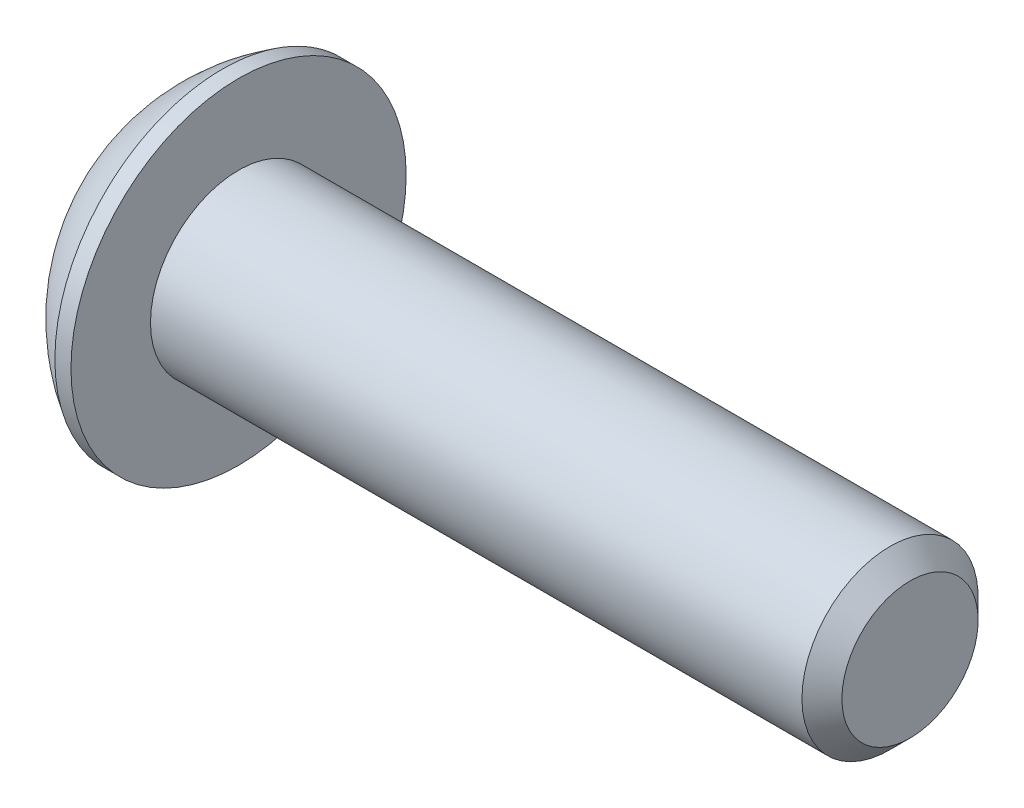
ISO-10303-21;
HEADER;
FILE_DESCRIPTION(('STEP AP214'),'2;1');
FILE_NAME('part.step','',(''),(''),'','','');
FILE_SCHEMA(('AUTOMOTIVE_DESIGN { 1 0 10303 214 1 1 1 1 }'));
ENDSEC;
DATA;
#1=APPLICATION_CONTEXT('core data for automotive mechanical design processes');
#2=APPLICATION_PROTOCOL_DEFINITION('international standard','automotive_design',2000,#1);
#3=PRODUCT_CONTEXT('',#1,'mechanical');
#4=PRODUCT('Part','Part','',(#3));
#5=PRODUCT_RELATED_PRODUCT_CATEGORY('part','',(#4));
#6=PRODUCT_DEFINITION_FORMATION('','',#4);
#7=PRODUCT_DEFINITION_CONTEXT('part definition',#1,'design');
#8=PRODUCT_DEFINITION('design','',#6,#7);
#9=PRODUCT_DEFINITION_SHAPE('','',#8);
#10=(LENGTH_UNIT() NAMED_UNIT(*) SI_UNIT(.MILLI.,.METRE.));
#11=(NAMED_UNIT(*) PLANE_ANGLE_UNIT() SI_UNIT($,.RADIAN.));
#12=(NAMED_UNIT(*) SI_UNIT($,.STERADIAN.) SOLID_ANGLE_UNIT());
#13=UNCERTAINTY_MEASURE_WITH_UNIT(LENGTH_MEASURE(1.E-05),#10,'distance_accuracy_value','');
#14=(GEOMETRIC_REPRESENTATION_CONTEXT(3) GLOBAL_UNCERTAINTY_ASSIGNED_CONTEXT((#13)) GLOBAL_UNIT_ASSIGNED_CONTEXT((#10,
#11,#12)) REPRESENTATION_CONTEXT('',''));
#15=CARTESIAN_POINT('',(0.,0.,0.));
#16=DIRECTION('',(0.,0.,1.));
#17=DIRECTION('',(1.,0.,0.));
#18=AXIS2_PLACEMENT_3D('',#15,#16,#17);
#19=CARTESIAN_POINT('',(1.32080000000034,0.,0.));
#20=DIRECTION('',(-1.,0.,0.));
#21=DIRECTION('',(0.,0.,1.));
#22=AXIS2_PLACEMENT_3D('',#19,#20,#21);
#23=CONICAL_SURFACE('',#22,1.1937999999998,1.04719755119608);
#24=CARTESIAN_POINT('',(2.01004075135902,0.,4.44089209850063E-13));
#25=VERTEX_POINT('',#24);
#26=VERTEX_LOOP('',#25);
#27=FACE_BOUND('',#26,.T.);
#28=CARTESIAN_POINT('',(1.32080000000009,0.,0.));
#29=DIRECTION('',(-1.,0.,0.));
#30=DIRECTION('',(0.,0.,1.));
#31=AXIS2_PLACEMENT_3D('',#28,#29,#30);
#32=CIRCLE('',#31,1.19380000000024);
#33=CARTESIAN_POINT('',(1.32080000000004,-1.03386112703797,0.59690000000006));
#34=VERTEX_POINT('',#33);
#35=CARTESIAN_POINT('',(1.32080000000004,0.,1.19380000000012));
#36=VERTEX_POINT('',#35);
#37=EDGE_CURVE('E19',#34,#36,#32,.T.);
#38=ORIENTED_EDGE('',*,*,#37,.T.);
#39=CARTESIAN_POINT('',(1.32080000000009,0.,0.));
#40=DIRECTION('',(-1.,0.,0.));
#41=DIRECTION('',(0.,0.,1.));
#42=AXIS2_PLACEMENT_3D('',#39,#40,#41);
#43=CIRCLE('',#42,1.19380000000024);
#44=CARTESIAN_POINT('',(1.32080000000004,1.03386112703797,0.596900000000061));
#45=VERTEX_POINT('',#44);
#46=EDGE_CURVE('E148',#36,#45,#43,.T.);
#47=ORIENTED_EDGE('',*,*,#46,.T.);
#48=CARTESIAN_POINT('',(1.32080000000009,0.,0.));
#49=DIRECTION('',(-1.,0.,0.));
#50=DIRECTION('',(0.,0.,1.));
#51=AXIS2_PLACEMENT_3D('',#48,#49,#50);
#52=CIRCLE('',#51,1.19380000000024);
#53=CARTESIAN_POINT('',(1.32080000000004,1.03386112703797,-0.596900000000061));
#54=VERTEX_POINT('',#53);
#55=EDGE_CURVE('E318',#45,#54,#52,.T.);
#56=ORIENTED_EDGE('',*,*,#55,.T.);
#57=CARTESIAN_POINT('',(1.32080000000009,0.,0.));
#58=DIRECTION('',(-1.,0.,0.));
#59=DIRECTION('',(0.,0.,1.));
#60=AXIS2_PLACEMENT_3D('',#57,#58,#59);
#61=CIRCLE('',#60,1.19380000000024);
#62=CARTESIAN_POINT('',(1.32080000000004,1.49457637585666E-12,-1.19380000000012));
#63=VERTEX_POINT('',#62);
#64=EDGE_CURVE('E319',#54,#63,#61,.T.);
#65=ORIENTED_EDGE('',*,*,#64,.T.);
#66=CARTESIAN_POINT('',(1.32080000000009,0.,0.));
#67=DIRECTION('',(-1.,0.,0.));
#68=DIRECTION('',(0.,0.,1.));
#69=AXIS2_PLACEMENT_3D('',#66,#67,#68);
#70=CIRCLE('',#69,1.19380000000024);
#71=CARTESIAN_POINT('',(1.32080000000004,-1.03386112703797,-0.59690000000006));
#72=VERTEX_POINT('',#71);
#73=EDGE_CURVE('E92',#63,#72,#70,.T.);
#74=ORIENTED_EDGE('',*,*,#73,.T.);
#75=CARTESIAN_POINT('',(1.32080000000009,0.,0.));
#76=DIRECTION('',(-1.,0.,0.));
#77=DIRECTION('',(0.,0.,1.));
#78=AXIS2_PLACEMENT_3D('',#75,#76,#77);
#79=CIRCLE('',#78,1.19380000000024);
#80=EDGE_CURVE('E88',#72,#34,#79,.T.);
#81=ORIENTED_EDGE('',*,*,#80,.T.);
#82=EDGE_LOOP('',(#38,#47,#56,#65,#74,#81));
#83=FACE_BOUND('',#82,.T.);
#84=ADVANCED_FACE('F16',(#27,#83),#23,.F.);
#85=CARTESIAN_POINT('',(1.3208,-2.06772225407572,-1.1938));
#86=DIRECTION('',(1.,0.,0.));
#87=DIRECTION('',(0.,0.,-1.));
#88=AXIS2_PLACEMENT_3D('',#85,#86,#87);
#89=PLANE('',#88);
#90=DIRECTION('',(0.,0.5,0.866025403784439));
#91=VECTOR('',#90,1.);
#92=CARTESIAN_POINT('',(1.3208,-1.37848150271715,0.));
#93=LINE('',#92,#91);
#94=CARTESIAN_POINT('',(1.3208,-0.689240751358574,1.1938));
#95=VERTEX_POINT('',#94);
#96=EDGE_CURVE('E100',#95,#34,#93,.F.);
#97=ORIENTED_EDGE('',*,*,#96,.F.);
#98=DIRECTION('',(0.,1.,0.));
#99=VECTOR('',#98,1.);
#100=CARTESIAN_POINT('',(1.3208,-0.689240751358574,1.1938));
#101=LINE('',#100,#99);
#102=EDGE_CURVE('E102',#36,#95,#101,.F.);
#103=ORIENTED_EDGE('',*,*,#102,.F.);
#104=ORIENTED_EDGE('',*,*,#37,.F.);
#105=EDGE_LOOP('',(#97,#103,#104));
#106=FACE_BOUND('',#105,.T.);
#107=ADVANCED_FACE('F98',(#106),#89,.F.);
#108=CARTESIAN_POINT('',(1.3208,-2.06772225407572,-1.1938));
#109=DIRECTION('',(1.,0.,0.));
#110=DIRECTION('',(0.,0.,-1.));
#111=AXIS2_PLACEMENT_3D('',#108,#109,#110);
#112=PLANE('',#111);
#113=DIRECTION('',(0.,-0.5,0.866025403784439));
#114=VECTOR('',#113,1.);
#115=CARTESIAN_POINT('',(1.3208,-0.689240751358574,-1.1938));
#116=LINE('',#115,#114);
#117=CARTESIAN_POINT('',(1.3208,-1.37848150271715,0.));
#118=VERTEX_POINT('',#117);
#119=EDGE_CURVE('E108',#118,#72,#116,.F.);
#120=ORIENTED_EDGE('',*,*,#119,.F.);
#121=DIRECTION('',(0.,0.5,0.866025403784439));
#122=VECTOR('',#121,1.);
#123=CARTESIAN_POINT('',(1.3208,-1.37848150271715,0.));
#124=LINE('',#123,#122);
#125=EDGE_CURVE('E105',#34,#118,#124,.F.);
#126=ORIENTED_EDGE('',*,*,#125,.F.);
#127=ORIENTED_EDGE('',*,*,#80,.F.);
#128=EDGE_LOOP('',(#120,#126,#127));
#129=FACE_BOUND('',#128,.T.);
#130=ADVANCED_FACE('F106',(#129),#112,.F.);
#131=CARTESIAN_POINT('',(1.3208,-2.06772225407572,-1.1938));
#132=DIRECTION('',(1.,0.,0.));
#133=DIRECTION('',(0.,0.,-1.));
#134=AXIS2_PLACEMENT_3D('',#131,#132,#133);
#135=PLANE('',#134);
#136=DIRECTION('',(0.,1.,0.));
#137=VECTOR('',#136,1.);
#138=CARTESIAN_POINT('',(1.3208,0.689240751358577,-1.1938));
#139=LINE('',#138,#137);
#140=CARTESIAN_POINT('',(1.3208,-0.689240751358574,-1.1938));
#141=VERTEX_POINT('',#140);
#142=EDGE_CURVE('E288',#141,#63,#139,.T.);
#143=ORIENTED_EDGE('',*,*,#142,.F.);
#144=DIRECTION('',(0.,-0.5,0.866025403784439));
#145=VECTOR('',#144,1.);
#146=CARTESIAN_POINT('',(1.3208,-0.689240751358574,-1.1938));
#147=LINE('',#146,#145);
#148=EDGE_CURVE('E300',#72,#141,#147,.F.);
#149=ORIENTED_EDGE('',*,*,#148,.F.);
#150=ORIENTED_EDGE('',*,*,#73,.F.);
#151=EDGE_LOOP('',(#143,#149,#150));
#152=FACE_BOUND('',#151,.T.);
#153=ADVANCED_FACE('F191',(#152),#135,.F.);
#154=CARTESIAN_POINT('',(1.3208,-2.06772225407572,-1.1938));
#155=DIRECTION('',(1.,0.,0.));
#156=DIRECTION('',(0.,0.,-1.));
#157=AXIS2_PLACEMENT_3D('',#154,#155,#156);
#158=PLANE('',#157);
#159=DIRECTION('',(0.,-0.5,-0.866025403784439));
#160=VECTOR('',#159,1.);
#161=CARTESIAN_POINT('',(1.3208,1.37848150271715,0.));
#162=LINE('',#161,#160);
#163=CARTESIAN_POINT('',(1.3208,0.689240751358577,-1.1938));
#164=VERTEX_POINT('',#163);
#165=EDGE_CURVE('E274',#164,#54,#162,.F.);
#166=ORIENTED_EDGE('',*,*,#165,.F.);
#167=DIRECTION('',(0.,1.,0.));
#168=VECTOR('',#167,1.);
#169=CARTESIAN_POINT('',(1.3208,0.689240751358577,-1.1938));
#170=LINE('',#169,#168);
#171=EDGE_CURVE('E285',#63,#164,#170,.T.);
#172=ORIENTED_EDGE('',*,*,#171,.F.);
#173=ORIENTED_EDGE('',*,*,#64,.F.);
#174=EDGE_LOOP('',(#166,#172,#173));
#175=FACE_BOUND('',#174,.T.);
#176=ADVANCED_FACE('F187',(#175),#158,.F.);
#177=CARTESIAN_POINT('',(1.3208,-2.06772225407572,-1.1938));
#178=DIRECTION('',(1.,0.,0.));
#179=DIRECTION('',(0.,0.,-1.));
#180=AXIS2_PLACEMENT_3D('',#177,#178,#179);
#181=PLANE('',#180);
#182=DIRECTION('',(0.,0.5,-0.866025403784439));
#183=VECTOR('',#182,1.);
#184=CARTESIAN_POINT('',(1.3208,0.689240751358576,1.1938));
#185=LINE('',#184,#183);
#186=CARTESIAN_POINT('',(1.3208,1.37848150271715,0.));
#187=VERTEX_POINT('',#186);
#188=EDGE_CURVE('E253',#187,#45,#185,.F.);
#189=ORIENTED_EDGE('',*,*,#188,.F.);
#190=DIRECTION('',(0.,-0.5,-0.866025403784439));
#191=VECTOR('',#190,1.);
#192=CARTESIAN_POINT('',(1.3208,1.37848150271715,0.));
#193=LINE('',#192,#191);
#194=EDGE_CURVE('E272',#54,#187,#193,.F.);
#195=ORIENTED_EDGE('',*,*,#194,.F.);
#196=ORIENTED_EDGE('',*,*,#55,.F.);
#197=EDGE_LOOP('',(#189,#195,#196));
#198=FACE_BOUND('',#197,.T.);
#199=ADVANCED_FACE('F183',(#198),#181,.F.);
#200=CARTESIAN_POINT('',(1.3208,-2.06772225407572,-1.1938));
#201=DIRECTION('',(1.,0.,0.));
#202=DIRECTION('',(0.,0.,-1.));
#203=AXIS2_PLACEMENT_3D('',#200,#201,#202);
#204=PLANE('',#203);
#205=DIRECTION('',(0.,1.,0.));
#206=VECTOR('',#205,1.);
#207=CARTESIAN_POINT('',(1.3208,-0.689240751358574,1.1938));
#208=LINE('',#207,#206);
#209=CARTESIAN_POINT('',(1.3208,0.689240751358576,1.1938));
#210=VERTEX_POINT('',#209);
#211=EDGE_CURVE('E117',#210,#36,#208,.F.);
#212=ORIENTED_EDGE('',*,*,#211,.F.);
#213=DIRECTION('',(0.,0.5,-0.866025403784439));
#214=VECTOR('',#213,1.);
#215=CARTESIAN_POINT('',(1.3208,0.689240751358576,1.1938));
#216=LINE('',#215,#214);
#217=EDGE_CURVE('E256',#45,#210,#216,.F.);
#218=ORIENTED_EDGE('',*,*,#217,.F.);
#219=ORIENTED_EDGE('',*,*,#46,.F.);
#220=EDGE_LOOP('',(#212,#218,#219));
#221=FACE_BOUND('',#220,.T.);
#222=ADVANCED_FACE('F179',(#221),#204,.F.);
#223=CARTESIAN_POINT('',(1.3208,-0.689240751358574,1.1938));
#224=DIRECTION('',(0.,0.,-1.));
#225=DIRECTION('',(0.,1.,0.));
#226=AXIS2_PLACEMENT_3D('',#223,#224,#225);
#227=PLANE('',#226);
#228=DIRECTION('',(0.,1.,0.));
#229=VECTOR('',#228,1.);
#230=CARTESIAN_POINT('',(0.,0.,1.1938));
#231=LINE('',#230,#229);
#232=CARTESIAN_POINT('',(0.,0.689240751358577,1.1938));
#233=VERTEX_POINT('',#232);
#234=CARTESIAN_POINT('',(0.,-0.689240751358574,1.1938));
#235=VERTEX_POINT('',#234);
#236=EDGE_CURVE('E250',#233,#235,#231,.F.);
#237=ORIENTED_EDGE('',*,*,#236,.F.);
#238=DIRECTION('',(1.,0.,0.));
#239=VECTOR('',#238,1.);
#240=CARTESIAN_POINT('',(1.3208,0.689240751358576,1.1938));
#241=LINE('',#240,#239);
#242=EDGE_CURVE('E262',#210,#233,#241,.F.);
#243=ORIENTED_EDGE('',*,*,#242,.F.);
#244=ORIENTED_EDGE('',*,*,#211,.T.);
#245=ORIENTED_EDGE('',*,*,#102,.T.);
#246=DIRECTION('',(1.,0.,0.));
#247=VECTOR('',#246,1.);
#248=CARTESIAN_POINT('',(1.3208,-0.689240751358574,1.1938));
#249=LINE('',#248,#247);
#250=EDGE_CURVE('E111',#235,#95,#249,.T.);
#251=ORIENTED_EDGE('',*,*,#250,.F.);
#252=EDGE_LOOP('',(#237,#243,#244,#245,#251));
#253=FACE_BOUND('',#252,.T.);
#254=ADVANCED_FACE('F176',(#253),#227,.T.);
#255=CARTESIAN_POINT('',(1.3208,-1.37848150271715,0.));
#256=DIRECTION('',(0.,0.866025403784439,-0.5));
#257=DIRECTION('',(0.,0.5,0.866025403784439));
#258=AXIS2_PLACEMENT_3D('',#255,#256,#257);
#259=PLANE('',#258);
#260=DIRECTION('',(0.,-0.5,-0.866025403784439));
#261=VECTOR('',#260,1.);
#262=CARTESIAN_POINT('',(0.,-0.689240751358574,1.1938));
#263=LINE('',#262,#261);
#264=CARTESIAN_POINT('',(0.,-1.37848150271715,0.));
#265=VERTEX_POINT('',#264);
#266=EDGE_CURVE('E247',#235,#265,#263,.T.);
#267=ORIENTED_EDGE('',*,*,#266,.F.);
#268=ORIENTED_EDGE('',*,*,#250,.T.);
#269=ORIENTED_EDGE('',*,*,#96,.T.);
#270=ORIENTED_EDGE('',*,*,#125,.T.);
#271=DIRECTION('',(1.,0.,0.));
#272=VECTOR('',#271,1.);
#273=CARTESIAN_POINT('',(1.3208,-1.37848150271715,0.));
#274=LINE('',#273,#272);
#275=EDGE_CURVE('E297',#265,#118,#274,.T.);
#276=ORIENTED_EDGE('',*,*,#275,.F.);
#277=EDGE_LOOP('',(#267,#268,#269,#270,#276));
#278=FACE_BOUND('',#277,.T.);
#279=ADVANCED_FACE('F115',(#278),#259,.T.);
#280=CARTESIAN_POINT('',(1.3208,-0.689240751358574,-1.1938));
#281=DIRECTION('',(0.,0.866025403784439,0.5));
#282=DIRECTION('',(0.,-0.5,0.866025403784439));
#283=AXIS2_PLACEMENT_3D('',#280,#281,#282);
#284=PLANE('',#283);
#285=DIRECTION('',(0.,0.5,-0.866025403784439));
#286=VECTOR('',#285,1.);
#287=CARTESIAN_POINT('',(0.,-1.37848150271715,0.));
#288=LINE('',#287,#286);
#289=CARTESIAN_POINT('',(0.,-0.689240751358574,-1.1938));
#290=VERTEX_POINT('',#289);
#291=EDGE_CURVE('E244',#265,#290,#288,.T.);
#292=ORIENTED_EDGE('',*,*,#291,.F.);
#293=ORIENTED_EDGE('',*,*,#275,.T.);
#294=ORIENTED_EDGE('',*,*,#119,.T.);
#295=ORIENTED_EDGE('',*,*,#148,.T.);
#296=DIRECTION('',(1.,0.,0.));
#297=VECTOR('',#296,1.);
#298=CARTESIAN_POINT('',(1.3208,-0.689240751358574,-1.1938));
#299=LINE('',#298,#297);
#300=EDGE_CURVE('E282',#290,#141,#299,.T.);
#301=ORIENTED_EDGE('',*,*,#300,.F.);
#302=EDGE_LOOP('',(#292,#293,#294,#295,#301));
#303=FACE_BOUND('',#302,.T.);
#304=ADVANCED_FACE('F169',(#303),#284,.T.);
#305=CARTESIAN_POINT('',(1.3208,0.689240751358577,-1.1938));
#306=DIRECTION('',(0.,0.,1.));
#307=DIRECTION('',(1.,0.,0.));
#308=AXIS2_PLACEMENT_3D('',#305,#306,#307);
#309=PLANE('',#308);
#310=DIRECTION('',(0.,1.,0.));
#311=VECTOR('',#310,1.);
#312=CARTESIAN_POINT('',(0.,0.,-1.1938));
#313=LINE('',#312,#311);
#314=CARTESIAN_POINT('',(0.,0.689240751358577,-1.1938));
#315=VERTEX_POINT('',#314);
#316=EDGE_CURVE('E241',#290,#315,#313,.T.);
#317=ORIENTED_EDGE('',*,*,#316,.F.);
#318=ORIENTED_EDGE('',*,*,#300,.T.);
#319=ORIENTED_EDGE('',*,*,#142,.T.);
#320=ORIENTED_EDGE('',*,*,#171,.T.);
#321=DIRECTION('',(1.,0.,0.));
#322=VECTOR('',#321,1.);
#323=CARTESIAN_POINT('',(1.3208,0.689240751358577,-1.1938));
#324=LINE('',#323,#322);
#325=EDGE_CURVE('E257',#315,#164,#324,.T.);
#326=ORIENTED_EDGE('',*,*,#325,.F.);
#327=EDGE_LOOP('',(#317,#318,#319,#320,#326));
#328=FACE_BOUND('',#327,.T.);
#329=ADVANCED_FACE('F166',(#328),#309,.T.);
#330=CARTESIAN_POINT('',(1.3208,1.37848150271715,0.));
#331=DIRECTION('',(0.,-0.866025403784439,0.5));
#332=DIRECTION('',(0.,-0.5,-0.866025403784439));
#333=AXIS2_PLACEMENT_3D('',#330,#331,#332);
#334=PLANE('',#333);
#335=DIRECTION('',(0.,0.5,0.866025403784439));
#336=VECTOR('',#335,1.);
#337=CARTESIAN_POINT('',(0.,0.689240751358577,-1.1938));
#338=LINE('',#337,#336);
#339=CARTESIAN_POINT('',(0.,1.37848150271715,0.));
#340=VERTEX_POINT('',#339);
#341=EDGE_CURVE('E238',#315,#340,#338,.T.);
#342=ORIENTED_EDGE('',*,*,#341,.F.);
#343=ORIENTED_EDGE('',*,*,#325,.T.);
#344=ORIENTED_EDGE('',*,*,#165,.T.);
#345=ORIENTED_EDGE('',*,*,#194,.T.);
#346=DIRECTION('',(1.,0.,0.));
#347=VECTOR('',#346,1.);
#348=CARTESIAN_POINT('',(1.3208,1.37848150271715,0.));
#349=LINE('',#348,#347);
#350=EDGE_CURVE('E34',#340,#187,#349,.T.);
#351=ORIENTED_EDGE('',*,*,#350,.F.);
#352=EDGE_LOOP('',(#342,#343,#344,#345,#351));
#353=FACE_BOUND('',#352,.T.);
#354=ADVANCED_FACE('F162',(#353),#334,.T.);
#355=CARTESIAN_POINT('',(1.3208,0.689240751358576,1.1938));
#356=DIRECTION('',(0.,-0.866025403784439,-0.5));
#357=DIRECTION('',(0.,0.5,-0.866025403784439));
#358=AXIS2_PLACEMENT_3D('',#355,#356,#357);
#359=PLANE('',#358);
#360=DIRECTION('',(0.,-0.5,0.866025403784439));
#361=VECTOR('',#360,1.);
#362=CARTESIAN_POINT('',(0.,1.37848150271715,0.));
#363=LINE('',#362,#361);
#364=EDGE_CURVE('E147',#340,#233,#363,.T.);
#365=ORIENTED_EDGE('',*,*,#364,.F.);
#366=ORIENTED_EDGE('',*,*,#350,.T.);
#367=ORIENTED_EDGE('',*,*,#188,.T.);
#368=ORIENTED_EDGE('',*,*,#217,.T.);
#369=ORIENTED_EDGE('',*,*,#242,.T.);
#370=EDGE_LOOP('',(#365,#366,#367,#368,#369));
#371=FACE_BOUND('',#370,.T.);
#372=ADVANCED_FACE('F158',(#371),#359,.T.);
#373=CARTESIAN_POINT('',(0.,0.,0.));
#374=DIRECTION('',(-1.,0.,0.));
#375=DIRECTION('',(0.,0.,1.));
#376=AXIS2_PLACEMENT_3D('',#373,#374,#375);
#377=PLANE('',#376);
#378=ORIENTED_EDGE('',*,*,#341,.T.);
#379=ORIENTED_EDGE('',*,*,#364,.T.);
#380=ORIENTED_EDGE('',*,*,#236,.T.);
#381=ORIENTED_EDGE('',*,*,#266,.T.);
#382=ORIENTED_EDGE('',*,*,#291,.T.);
#383=ORIENTED_EDGE('',*,*,#316,.T.);
#384=EDGE_LOOP('',(#378,#379,#380,#381,#382,#383));
#385=FACE_BOUND('',#384,.T.);
#386=CARTESIAN_POINT('',(0.,1.9812,0.));
#387=CARTESIAN_POINT('',(0.,1.9811996664299,0.0556258831179428));
#388=CARTESIAN_POINT('',(0.,1.97885520380442,0.111261989398606));
#389=CARTESIAN_POINT('',(0.,1.96949260169541,0.222149719830458));
#390=CARTESIAN_POINT('',(0.,1.96247308239605,0.277401225602895));
#391=CARTESIAN_POINT('',(0.,1.94379192841038,0.387209508139747));
#392=CARTESIAN_POINT('',(-1.85325793235264E-13,1.93212292489526,0.441765039546365));
#393=CARTESIAN_POINT('',(1.86344214223505E-13,1.90422331175315,0.549729449347493));
#394=CARTESIAN_POINT('',(6.94543371897454E-13,1.88798900035338,0.603137359208869));
#395=CARTESIAN_POINT('',(1.15501975216981E-12,1.83266214476501,0.760839131321828));
#396=CARTESIAN_POINT('',(0.,1.78690023648845,0.862876433575429));
#397=CARTESIAN_POINT('',(0.,1.67887358150667,1.05780719540872));
#398=CARTESIAN_POINT('',(9.54193214892627E-13,1.6166082074585,1.15070030720801));
#399=CARTESIAN_POINT('',(5.94805591894675E-13,1.51224157140982,1.28116890915697));
#400=CARTESIAN_POINT('',(1.63221293851378E-13,1.4755970394354,1.32320451127026));
#401=CARTESIAN_POINT('',(-1.62196980336157E-13,1.39893832619713,1.40400288695709));
#402=CARTESIAN_POINT('',(0.,1.35892742784698,1.44276877695455));
#403=CARTESIAN_POINT('',(1.14362537325405E-13,1.23416504602197,1.55382272417904));
#404=CARTESIAN_POINT('',(0.,1.14466125559859,1.62089527952111));
#405=CARTESIAN_POINT('',(0.,0.955712144178167,1.7390221808118));
#406=CARTESIAN_POINT('',(0.,0.856267198233564,1.79007713076007));
#407=CARTESIAN_POINT('',(0.,0.650206345910843,1.87477637530954));
#408=CARTESIAN_POINT('',(0.,0.543590516134855,1.90842085586267));
#409=CARTESIAN_POINT('',(0.,0.326226155292018,1.95733039300656));
#410=CARTESIAN_POINT('',(0.,0.21547760215793,1.97259535144288));
#411=CARTESIAN_POINT('',(0.,-0.00701040587544639,1.98431697865418));
#412=CARTESIAN_POINT('',(0.,-0.118749860774734,1.98077364742917));
#413=CARTESIAN_POINT('',(0.,-0.340050178355485,1.95497485623825));
#414=CARTESIAN_POINT('',(0.,-0.449611052668255,1.93271949620218));
#415=CARTESIAN_POINT('',(0.,-0.663431110729174,1.87014138774523));
#416=CARTESIAN_POINT('',(0.,-0.76769023783852,1.82981844635272));
#417=CARTESIAN_POINT('',(0.,-0.968005760719347,1.73219968377096));
#418=CARTESIAN_POINT('',(0.,-1.0640618469811,1.6749032225164));
#419=CARTESIAN_POINT('',(0.,-1.19980276751283,1.57757371205873));
#420=CARTESIAN_POINT('',(0.,-1.24366557129213,1.54322665019466));
#421=CARTESIAN_POINT('',(0.,-1.32838995706696,1.47093063174264));
#422=CARTESIAN_POINT('',(0.,-1.36924860178706,1.43297823102439));
#423=CARTESIAN_POINT('',(0.,-1.48674671849223,1.31419842051173));
#424=CARTESIAN_POINT('',(0.,-1.55842832343237,1.22836221289311));
#425=CARTESIAN_POINT('',(0.,-1.6863396856475,1.04586168272493));
#426=CARTESIAN_POINT('',(0.,-1.7425700302488,0.949197771949774));
#427=CARTESIAN_POINT('',(0.,-1.8141614250401,0.798182600298684));
#428=CARTESIAN_POINT('',(0.,-1.83591780585875,0.746776203847791));
#429=CARTESIAN_POINT('',(0.,-1.87500754181092,0.642341081688636));
#430=CARTESIAN_POINT('',(0.,-1.89234447645404,0.589313708122847));
#431=CARTESIAN_POINT('',(0.,-1.92246053433554,0.482076273028395));
#432=CARTESIAN_POINT('',(0.,-1.93524685475118,0.42786822425751));
#433=CARTESIAN_POINT('',(0.,-1.95620937250494,0.318578151844611));
#434=CARTESIAN_POINT('',(0.,-1.96438692958147,0.263496390912872));
#435=CARTESIAN_POINT('',(0.,-1.97388528284653,0.173607715038558));
#436=CARTESIAN_POINT('',(0.,-1.97662743364426,0.138944718024998));
#437=CARTESIAN_POINT('',(0.,-1.98028489645283,0.0695224782567002));
#438=CARTESIAN_POINT('',(0.,-1.98120020846367,0.0347632355019631));
#439=CARTESIAN_POINT('',(0.,-1.9811996664299,-0.0556258831179437));
#440=CARTESIAN_POINT('',(0.,-1.97885520380442,-0.111261989398607));
#441=CARTESIAN_POINT('',(0.,-1.96949260169541,-0.222149719830459));
#442=CARTESIAN_POINT('',(0.,-1.96247308239605,-0.277401225602897));
#443=CARTESIAN_POINT('',(0.,-1.94379192841039,-0.387209508139749));
#444=CARTESIAN_POINT('',(-1.85269749640691E-13,-1.93212292489526,-0.441765039546367));
#445=CARTESIAN_POINT('',(1.86288125054388E-13,-1.90422331175315,-0.549729449347495));
#446=CARTESIAN_POINT('',(6.94525090263764E-13,-1.88798900035338,-0.603137359208872));
#447=CARTESIAN_POINT('',(1.15505622829081E-12,-1.83266214476501,-0.760839131321831));
#448=CARTESIAN_POINT('',(0.,-1.78690023648845,-0.862876433575431));
#449=CARTESIAN_POINT('',(0.,-1.67887358150667,-1.05780719540872));
#450=CARTESIAN_POINT('',(9.54248812869379E-13,-1.6166082074585,-1.15070030720801));
#451=CARTESIAN_POINT('',(5.94777756479239E-13,-1.51224157140982,-1.28116890915698));
#452=CARTESIAN_POINT('',(1.63138949183833E-13,-1.47559703943539,-1.32320451127027));
#453=CARTESIAN_POINT('',(-1.62114715061273E-13,-1.39893832619713,-1.40400288695709));
#454=CARTESIAN_POINT('',(0.,-1.35892742784699,-1.44276877695455));
#455=CARTESIAN_POINT('',(1.13760489124207E-13,-1.23416504602197,-1.55382272417904));
#456=CARTESIAN_POINT('',(0.,-1.14466125559859,-1.62089527952111));
#457=CARTESIAN_POINT('',(0.,-0.95571214417816,-1.73902218081179));
#458=CARTESIAN_POINT('',(0.,-0.856267198233559,-1.79007713076007));
#459=CARTESIAN_POINT('',(0.,-0.650206345910841,-1.87477637530954));
#460=CARTESIAN_POINT('',(0.,-0.543590516134854,-1.90842085586267));
#461=CARTESIAN_POINT('',(0.,-0.326226155292018,-1.95733039300657));
#462=CARTESIAN_POINT('',(0.,-0.215477602157929,-1.97259535144288));
#463=CARTESIAN_POINT('',(0.,0.0070104058754487,-1.98431697865418));
#464=CARTESIAN_POINT('',(0.,0.118749860774737,-1.98077364742916));
#465=CARTESIAN_POINT('',(0.,0.340050178355489,-1.95497485623824));
#466=CARTESIAN_POINT('',(0.,0.44961105266826,-1.93271949620218));
#467=CARTESIAN_POINT('',(0.,0.663431110729178,-1.87014138774524));
#468=CARTESIAN_POINT('',(0.,0.767690237838524,-1.82981844635272));
#469=CARTESIAN_POINT('',(0.,0.968005760719348,-1.73219968377096));
#470=CARTESIAN_POINT('',(0.,1.0640618469811,-1.67490322251639));
#471=CARTESIAN_POINT('',(0.,1.19980276751283,-1.57757371205873));
#472=CARTESIAN_POINT('',(0.,1.24366557129214,-1.54322665019465));
#473=CARTESIAN_POINT('',(0.,1.32838995706696,-1.47093063174263));
#474=CARTESIAN_POINT('',(0.,1.36924860178706,-1.43297823102439));
#475=CARTESIAN_POINT('',(0.,1.48674671849223,-1.31419842051172));
#476=CARTESIAN_POINT('',(0.,1.55842832343237,-1.22836221289311));
#477=CARTESIAN_POINT('',(0.,1.6863396856475,-1.04586168272492));
#478=CARTESIAN_POINT('',(0.,1.7425700302488,-0.949197771949768));
#479=CARTESIAN_POINT('',(0.,1.8141614250401,-0.798182600298677));
#480=CARTESIAN_POINT('',(0.,1.83591780585875,-0.746776203847785));
#481=CARTESIAN_POINT('',(0.,1.87500754181092,-0.64234108168863));
#482=CARTESIAN_POINT('',(0.,1.89234447645404,-0.589313708122841));
#483=CARTESIAN_POINT('',(0.,1.92246053433555,-0.482076273028389));
#484=CARTESIAN_POINT('',(0.,1.93524685475118,-0.427868224257505));
#485=CARTESIAN_POINT('',(0.,1.95620937250494,-0.318578151844605));
#486=CARTESIAN_POINT('',(0.,1.96438692958147,-0.263496390912866));
#487=CARTESIAN_POINT('',(0.,1.97388528284653,-0.173607715038553));
#488=CARTESIAN_POINT('',(0.,1.97662743364426,-0.138944718024994));
#489=CARTESIAN_POINT('',(0.,1.98028489645283,-0.0695224782566989));
#490=CARTESIAN_POINT('',(0.,1.98120020846367,-0.034763235501963));
#491=CARTESIAN_POINT('',(0.,1.9812,0.));
#492=B_SPLINE_CURVE_WITH_KNOTS('',3,(#386,#387,#388,#389,#390,#391,#392,#393,#394,#395,#396,
#397,#398,#399,#400,#401,#402,#403,#404,#405,#406,#407,#408,#409,#410,#411,#412,#413,#414,#415,
#416,#417,#418,#419,#420,#421,#422,#423,#424,#425,#426,#427,#428,#429,#430,#431,#432,#433,#434,
#435,#436,#437,#438,#439,#440,#441,#442,#443,#444,#445,#446,#447,#448,#449,#450,#451,#452,#453,
#454,#455,#456,#457,#458,#459,#460,#461,#462,#463,#464,#465,#466,#467,#468,#469,#470,#471,#472,
#473,#474,#475,#476,#477,#478,#479,#480,#481,#482,#483,#484,#485,#486,#487,#488,#489,#490,#491),
.UNSPECIFIED.,.T.,.F.,(4,2,2,2,2,2,2,2,2,2,2,2,2,2,2,2,2,2,2,2,2,2,2,2,2,2,2,2,2,2,2,2,2,2,2,2,
2,2,2,2,2,2,2,2,2,2,2,2,2,2,2,2,4),(0.,0.166845646007828,0.333740557374255,0.500901034367693,
0.668197445942386,1.00199278686282,1.33580081809885,1.50292354032982,1.6698851310853,
2.00370118900129,2.33750465770544,2.67130456115909,3.005106247238,3.33890793331696,
3.67270783677065,4.00651130547476,4.34032736339026,4.50728895414554,4.67441167637632,
5.00821970761259,5.34201504853332,5.50931146010827,5.67647193710191,5.84336684846844,
6.0102124944764,6.11448220058334,6.21875190669029,6.38559755269812,6.55249246406454,
6.71965294105798,6.88694935263268,7.22074469355311,7.55455272478915,7.72167544702011,
7.88863703777559,8.22245309569158,8.55625656439573,8.89005646784938,9.2238581539283,
9.55765984000725,9.89145974346094,10.2252632121651,10.5590792700806,10.7260408608358,
10.8931635830666,11.2269716143029,11.5607669552236,11.7280633667986,11.8952238437922,
12.0621187551587,12.2289644011667,12.3332341072736,12.4375038133806),.UNSPECIFIED.);
#493=CARTESIAN_POINT('',(0.,1.9812,0.));
#494=VERTEX_POINT('',#493);
#495=EDGE_CURVE('E139',#494,#494,#492,.T.);
#496=ORIENTED_EDGE('',*,*,#495,.F.);
#497=EDGE_LOOP('',(#496));
#498=FACE_BOUND('',#497,.T.);
#499=ADVANCED_FACE('F154',(#385,#498),#377,.T.);
#500=CARTESIAN_POINT('',(4.13385,0.,0.));
#501=DIRECTION('',(0.,1.,0.));
#502=DIRECTION('',(1.,0.,0.));
#503=AXIS2_PLACEMENT_3D('',#500,#501,#502);
#504=SPHERICAL_SURFACE('',#503,4.58408870578439);
#505=CARTESIAN_POINT('',(1.8288,0.,0.));
#506=DIRECTION('',(-1.,0.,0.));
#507=DIRECTION('',(0.,0.,1.));
#508=AXIS2_PLACEMENT_3D('',#505,#506,#507);
#509=CIRCLE('',#508,3.9624);
#510=CARTESIAN_POINT('',(1.8288,0.,3.9624));
#511=VERTEX_POINT('',#510);
#512=EDGE_CURVE('E136',#511,#511,#509,.F.);
#513=ORIENTED_EDGE('',*,*,#512,.F.);
#514=EDGE_LOOP('',(#513));
#515=FACE_BOUND('',#514,.T.);
#516=ORIENTED_EDGE('',*,*,#495,.T.);
#517=EDGE_LOOP('',(#516));
#518=FACE_BOUND('',#517,.T.);
#519=ADVANCED_FACE('F150',(#515,#518),#504,.T.);
#520=CARTESIAN_POINT('',(18.0848,0.,0.));
#521=DIRECTION('',(-1.,0.,0.));
#522=DIRECTION('',(0.,0.,1.));
#523=AXIS2_PLACEMENT_3D('',#520,#521,#522);
#524=PLANE('',#523);
#525=CARTESIAN_POINT('',(18.0847999999969,0.,0.));
#526=DIRECTION('',(-1.,0.,0.));
#527=DIRECTION('',(0.,0.,1.));
#528=AXIS2_PLACEMENT_3D('',#525,#526,#527);
#529=CIRCLE('',#528,1.61036000002923);
#530=CARTESIAN_POINT('',(18.0847999999969,0.,1.61036000002923));
#531=VERTEX_POINT('',#530);
#532=EDGE_CURVE('E133',#531,#531,#529,.T.);
#533=ORIENTED_EDGE('',*,*,#532,.F.);
#534=EDGE_LOOP('',(#533));
#535=FACE_BOUND('',#534,.T.);
#536=ADVANCED_FACE('F222',(#535),#524,.F.);
#537=CARTESIAN_POINT('',(0.,0.,0.));
#538=DIRECTION('',(-1.,0.,0.));
#539=DIRECTION('',(0.,0.,1.));
#540=AXIS2_PLACEMENT_3D('',#537,#538,#539);
#541=CYLINDRICAL_SURFACE('',#540,3.9624);
#542=ORIENTED_EDGE('',*,*,#512,.T.);
#543=EDGE_LOOP('',(#542));
#544=FACE_BOUND('',#543,.T.);
#545=CARTESIAN_POINT('',(2.2098,0.,0.));
#546=DIRECTION('',(-1.,0.,0.));
#547=DIRECTION('',(0.,0.,1.));
#548=AXIS2_PLACEMENT_3D('',#545,#546,#547);
#549=CIRCLE('',#548,3.9624);
#550=CARTESIAN_POINT('',(2.2098,0.,3.9624));
#551=VERTEX_POINT('',#550);
#552=EDGE_CURVE('E130',#551,#551,#549,.T.);
#553=ORIENTED_EDGE('',*,*,#552,.T.);
#554=EDGE_LOOP('',(#553));
#555=FACE_BOUND('',#554,.T.);
#556=ADVANCED_FACE('F219',(#544,#555),#541,.T.);
#557=CARTESIAN_POINT('',(17.61235999993,0.,0.));
#558=DIRECTION('',(-1.,0.,0.));
#559=DIRECTION('',(0.,0.,1.));
#560=AXIS2_PLACEMENT_3D('',#557,#558,#559);
#561=CONICAL_SURFACE('',#560,2.08280000009609,0.785398163397448);
#562=ORIENTED_EDGE('',*,*,#532,.T.);
#563=EDGE_LOOP('',(#562));
#564=FACE_BOUND('',#563,.T.);
#565=CARTESIAN_POINT('',(17.61236,0.,0.));
#566=DIRECTION('',(-1.,0.,0.));
#567=DIRECTION('',(0.,0.,1.));
#568=AXIS2_PLACEMENT_3D('',#565,#566,#567);
#569=CIRCLE('',#568,2.0828);
#570=CARTESIAN_POINT('',(17.61236,0.,2.0828));
#571=VERTEX_POINT('',#570);
#572=EDGE_CURVE('E25',#571,#571,#569,.T.);
#573=ORIENTED_EDGE('',*,*,#572,.F.);
#574=EDGE_LOOP('',(#573));
#575=FACE_BOUND('',#574,.T.);
#576=ADVANCED_FACE('F211',(#564,#575),#561,.T.);
#577=CARTESIAN_POINT('',(2.2098,2.0828,0.));
#578=DIRECTION('',(-1.,0.,0.));
#579=DIRECTION('',(0.,0.,1.));
#580=AXIS2_PLACEMENT_3D('',#577,#578,#579);
#581=PLANE('',#580);
#582=CARTESIAN_POINT('',(2.2098,0.,0.));
#583=DIRECTION('',(-1.,0.,0.));
#584=DIRECTION('',(0.,0.,1.));
#585=AXIS2_PLACEMENT_3D('',#582,#583,#584);
#586=CIRCLE('',#585,2.0828);
#587=CARTESIAN_POINT('',(2.2098,0.,2.0828));
#588=VERTEX_POINT('',#587);
#589=EDGE_CURVE('E11',#588,#588,#586,.F.);
#590=ORIENTED_EDGE('',*,*,#589,.F.);
#591=EDGE_LOOP('',(#590));
#592=FACE_BOUND('',#591,.T.);
#593=ORIENTED_EDGE('',*,*,#552,.F.);
#594=EDGE_LOOP('',(#593));
#595=FACE_BOUND('',#594,.T.);
#596=ADVANCED_FACE('F205',(#592,#595),#581,.F.);
#597=CARTESIAN_POINT('',(0.,0.,0.));
#598=DIRECTION('',(-1.,0.,0.));
#599=DIRECTION('',(0.,0.,1.));
#600=AXIS2_PLACEMENT_3D('',#597,#598,#599);
#601=CYLINDRICAL_SURFACE('',#600,2.0828);
#602=ORIENTED_EDGE('',*,*,#572,.T.);
#603=EDGE_LOOP('',(#602));
#604=FACE_BOUND('',#603,.T.);
#605=ORIENTED_EDGE('',*,*,#589,.T.);
#606=EDGE_LOOP('',(#605));
#607=FACE_BOUND('',#606,.T.);
#608=ADVANCED_FACE('F203',(#604,#607),#601,.T.);
#609=CLOSED_SHELL('',(#84,#107,#130,#153,#176,#199,#222,#254,#279,#304,#329,#354,#372,#499,#519,
#536,#556,#576,#596,#608));
#610=MANIFOLD_SOLID_BREP('B1',#609);
#611=ADVANCED_BREP_SHAPE_REPRESENTATION('',(#18,#610),#14);
#612=SHAPE_DEFINITION_REPRESENTATION(#9,#611);
ENDSEC;
END-ISO-10303-21;
